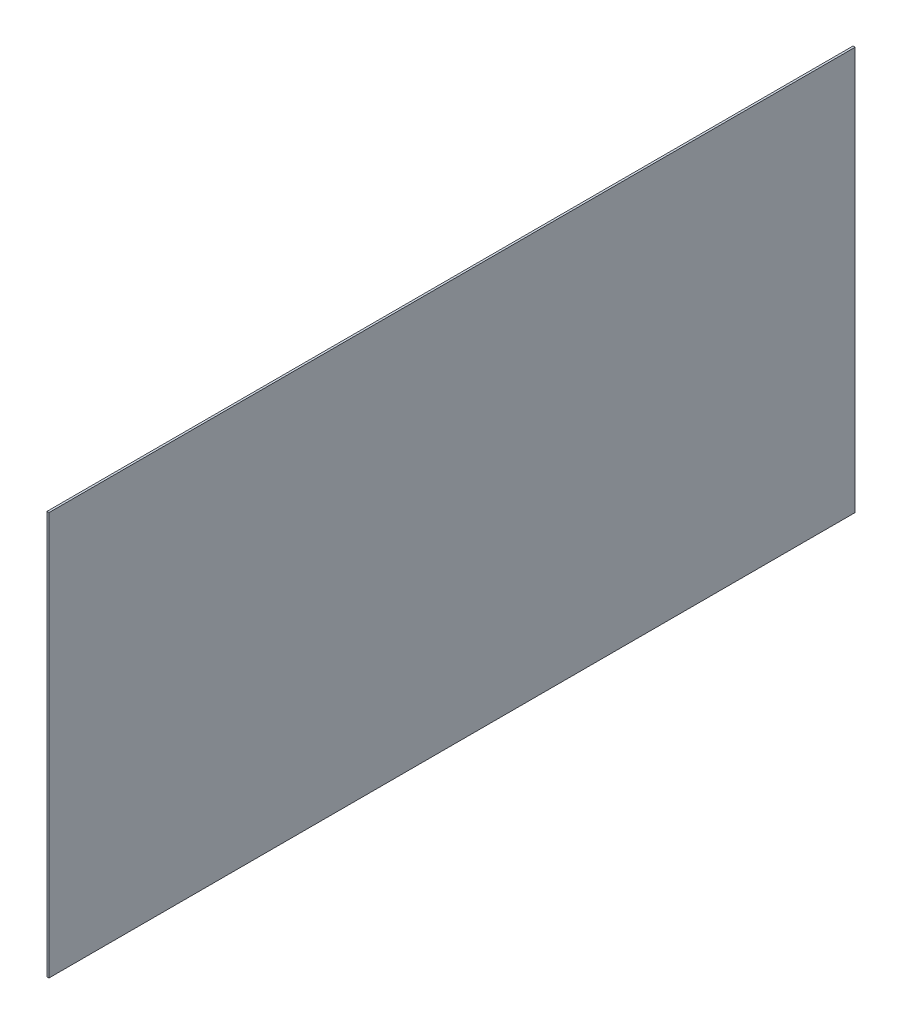
ISO-10303-21;
HEADER;
FILE_DESCRIPTION(('STEP AP214'),'2;1');
FILE_NAME('part.step','',(''),(''),'','','');
FILE_SCHEMA(('AUTOMOTIVE_DESIGN { 1 0 10303 214 1 1 1 1 }'));
ENDSEC;
DATA;
#1=APPLICATION_CONTEXT('core data for automotive mechanical design processes');
#2=APPLICATION_PROTOCOL_DEFINITION('international standard','automotive_design',2000,#1);
#3=PRODUCT_CONTEXT('',#1,'mechanical');
#4=PRODUCT('Part','Part','',(#3));
#5=PRODUCT_RELATED_PRODUCT_CATEGORY('part','',(#4));
#6=PRODUCT_DEFINITION_FORMATION('','',#4);
#7=PRODUCT_DEFINITION_CONTEXT('part definition',#1,'design');
#8=PRODUCT_DEFINITION('design','',#6,#7);
#9=PRODUCT_DEFINITION_SHAPE('','',#8);
#10=(LENGTH_UNIT() NAMED_UNIT(*) SI_UNIT(.MILLI.,.METRE.));
#11=(NAMED_UNIT(*) PLANE_ANGLE_UNIT() SI_UNIT($,.RADIAN.));
#12=(NAMED_UNIT(*) SI_UNIT($,.STERADIAN.) SOLID_ANGLE_UNIT());
#13=UNCERTAINTY_MEASURE_WITH_UNIT(LENGTH_MEASURE(1.E-05),#10,'distance_accuracy_value','');
#14=(GEOMETRIC_REPRESENTATION_CONTEXT(3) GLOBAL_UNCERTAINTY_ASSIGNED_CONTEXT((#13)) GLOBAL_UNIT_ASSIGNED_CONTEXT((#10,
#11,#12)) REPRESENTATION_CONTEXT('',''));
#15=CARTESIAN_POINT('',(0.,0.,0.));
#16=DIRECTION('',(0.,0.,1.));
#17=DIRECTION('',(1.,0.,0.));
#18=AXIS2_PLACEMENT_3D('',#15,#16,#17);
#19=CARTESIAN_POINT('',(4.7625,0.,0.));
#20=DIRECTION('',(0.,0.,-1.));
#21=DIRECTION('',(-1.,0.,0.));
#22=AXIS2_PLACEMENT_3D('',#19,#20,#21);
#23=PLANE('',#22);
#24=DIRECTION('',(0.,-1.,0.));
#25=VECTOR('',#24,1.);
#26=CARTESIAN_POINT('',(0.,0.,0.));
#27=LINE('',#26,#25);
#28=CARTESIAN_POINT('',(0.,914.4,0.));
#29=VERTEX_POINT('',#28);
#30=CARTESIAN_POINT('',(0.,0.,0.));
#31=VERTEX_POINT('',#30);
#32=EDGE_CURVE('E97',#29,#31,#27,.T.);
#33=ORIENTED_EDGE('',*,*,#32,.T.);
#34=DIRECTION('',(-1.,0.,0.));
#35=VECTOR('',#34,1.);
#36=CARTESIAN_POINT('',(4.7625,0.,0.));
#37=LINE('',#36,#35);
#38=CARTESIAN_POINT('',(4.7625,0.,0.));
#39=VERTEX_POINT('',#38);
#40=EDGE_CURVE('E11',#39,#31,#37,.T.);
#41=ORIENTED_EDGE('',*,*,#40,.F.);
#42=DIRECTION('',(0.,-1.,0.));
#43=VECTOR('',#42,1.);
#44=CARTESIAN_POINT('',(4.7625,0.,0.));
#45=LINE('',#44,#43);
#46=CARTESIAN_POINT('',(4.7625,914.4,0.));
#47=VERTEX_POINT('',#46);
#48=EDGE_CURVE('E85',#47,#39,#45,.T.);
#49=ORIENTED_EDGE('',*,*,#48,.F.);
#50=DIRECTION('',(-1.,0.,0.));
#51=VECTOR('',#50,1.);
#52=CARTESIAN_POINT('',(4.7625,914.4,0.));
#53=LINE('',#52,#51);
#54=EDGE_CURVE('E93',#47,#29,#53,.T.);
#55=ORIENTED_EDGE('',*,*,#54,.T.);
#56=EDGE_LOOP('',(#33,#41,#49,#55));
#57=FACE_BOUND('',#56,.T.);
#58=ADVANCED_FACE('F34',(#57),#23,.F.);
#59=CARTESIAN_POINT('',(4.7625,0.,0.));
#60=DIRECTION('',(0.,1.,0.));
#61=DIRECTION('',(0.,0.,1.));
#62=AXIS2_PLACEMENT_3D('',#59,#60,#61);
#63=PLANE('',#62);
#64=DIRECTION('',(0.,0.,-1.));
#65=VECTOR('',#64,1.);
#66=CARTESIAN_POINT('',(0.,0.,0.));
#67=LINE('',#66,#65);
#68=CARTESIAN_POINT('',(0.,0.,-1828.8));
#69=VERTEX_POINT('',#68);
#70=EDGE_CURVE('E89',#31,#69,#67,.T.);
#71=ORIENTED_EDGE('',*,*,#70,.T.);
#72=DIRECTION('',(-1.,0.,0.));
#73=VECTOR('',#72,1.);
#74=CARTESIAN_POINT('',(4.7625,0.,-1828.8));
#75=LINE('',#74,#73);
#76=CARTESIAN_POINT('',(4.7625,0.,-1828.8));
#77=VERTEX_POINT('',#76);
#78=EDGE_CURVE('E42',#77,#69,#75,.T.);
#79=ORIENTED_EDGE('',*,*,#78,.F.);
#80=DIRECTION('',(0.,0.,-1.));
#81=VECTOR('',#80,1.);
#82=CARTESIAN_POINT('',(4.7625,0.,0.));
#83=LINE('',#82,#81);
#84=EDGE_CURVE('E80',#39,#77,#83,.T.);
#85=ORIENTED_EDGE('',*,*,#84,.F.);
#86=ORIENTED_EDGE('',*,*,#40,.T.);
#87=EDGE_LOOP('',(#71,#79,#85,#86));
#88=FACE_BOUND('',#87,.T.);
#89=ADVANCED_FACE('F88',(#88),#63,.F.);
#90=CARTESIAN_POINT('',(4.7625,0.,-1828.8));
#91=DIRECTION('',(0.,0.,1.));
#92=DIRECTION('',(1.,0.,0.));
#93=AXIS2_PLACEMENT_3D('',#90,#91,#92);
#94=PLANE('',#93);
#95=DIRECTION('',(0.,1.,0.));
#96=VECTOR('',#95,1.);
#97=CARTESIAN_POINT('',(0.,0.,-1828.8));
#98=LINE('',#97,#96);
#99=CARTESIAN_POINT('',(0.,914.4,-1828.8));
#100=VERTEX_POINT('',#99);
#101=EDGE_CURVE('E67',#69,#100,#98,.T.);
#102=ORIENTED_EDGE('',*,*,#101,.T.);
#103=DIRECTION('',(-1.,0.,0.));
#104=VECTOR('',#103,1.);
#105=CARTESIAN_POINT('',(4.7625,914.4,-1828.8));
#106=LINE('',#105,#104);
#107=CARTESIAN_POINT('',(4.7625,914.4,-1828.8));
#108=VERTEX_POINT('',#107);
#109=EDGE_CURVE('E90',#108,#100,#106,.T.);
#110=ORIENTED_EDGE('',*,*,#109,.F.);
#111=DIRECTION('',(0.,1.,0.));
#112=VECTOR('',#111,1.);
#113=CARTESIAN_POINT('',(4.7625,0.,-1828.8));
#114=LINE('',#113,#112);
#115=EDGE_CURVE('E83',#77,#108,#114,.T.);
#116=ORIENTED_EDGE('',*,*,#115,.F.);
#117=ORIENTED_EDGE('',*,*,#78,.T.);
#118=EDGE_LOOP('',(#102,#110,#116,#117));
#119=FACE_BOUND('',#118,.T.);
#120=ADVANCED_FACE('F91',(#119),#94,.F.);
#121=CARTESIAN_POINT('',(4.7625,914.4,0.));
#122=DIRECTION('',(0.,-1.,0.));
#123=DIRECTION('',(0.,0.,-1.));
#124=AXIS2_PLACEMENT_3D('',#121,#122,#123);
#125=PLANE('',#124);
#126=DIRECTION('',(0.,0.,1.));
#127=VECTOR('',#126,1.);
#128=CARTESIAN_POINT('',(0.,914.4,0.));
#129=LINE('',#128,#127);
#130=EDGE_CURVE('E73',#100,#29,#129,.T.);
#131=ORIENTED_EDGE('',*,*,#130,.T.);
#132=ORIENTED_EDGE('',*,*,#54,.F.);
#133=DIRECTION('',(0.,0.,1.));
#134=VECTOR('',#133,1.);
#135=CARTESIAN_POINT('',(4.7625,914.4,0.));
#136=LINE('',#135,#134);
#137=EDGE_CURVE('E50',#108,#47,#136,.T.);
#138=ORIENTED_EDGE('',*,*,#137,.F.);
#139=ORIENTED_EDGE('',*,*,#109,.T.);
#140=EDGE_LOOP('',(#131,#132,#138,#139));
#141=FACE_BOUND('',#140,.T.);
#142=ADVANCED_FACE('F104',(#141),#125,.F.);
#143=CARTESIAN_POINT('',(4.7625,0.,0.));
#144=DIRECTION('',(-1.,0.,0.));
#145=DIRECTION('',(0.,0.,1.));
#146=AXIS2_PLACEMENT_3D('',#143,#144,#145);
#147=PLANE('',#146);
#148=ORIENTED_EDGE('',*,*,#48,.T.);
#149=ORIENTED_EDGE('',*,*,#84,.T.);
#150=ORIENTED_EDGE('',*,*,#115,.T.);
#151=ORIENTED_EDGE('',*,*,#137,.T.);
#152=EDGE_LOOP('',(#148,#149,#150,#151));
#153=FACE_BOUND('',#152,.T.);
#154=ADVANCED_FACE('F81',(#153),#147,.F.);
#155=CARTESIAN_POINT('',(0.,0.,0.));
#156=DIRECTION('',(-1.,0.,0.));
#157=DIRECTION('',(0.,0.,1.));
#158=AXIS2_PLACEMENT_3D('',#155,#156,#157);
#159=PLANE('',#158);
#160=ORIENTED_EDGE('',*,*,#32,.F.);
#161=ORIENTED_EDGE('',*,*,#130,.F.);
#162=ORIENTED_EDGE('',*,*,#101,.F.);
#163=ORIENTED_EDGE('',*,*,#70,.F.);
#164=EDGE_LOOP('',(#160,#161,#162,#163));
#165=FACE_BOUND('',#164,.T.);
#166=ADVANCED_FACE('F107',(#165),#159,.T.);
#167=CLOSED_SHELL('',(#58,#89,#120,#142,#154,#166));
#168=MANIFOLD_SOLID_BREP('B2',#167);
#169=ADVANCED_BREP_SHAPE_REPRESENTATION('',(#18,#168),#14);
#170=SHAPE_DEFINITION_REPRESENTATION(#9,#169);
ENDSEC;
END-ISO-10303-21;
